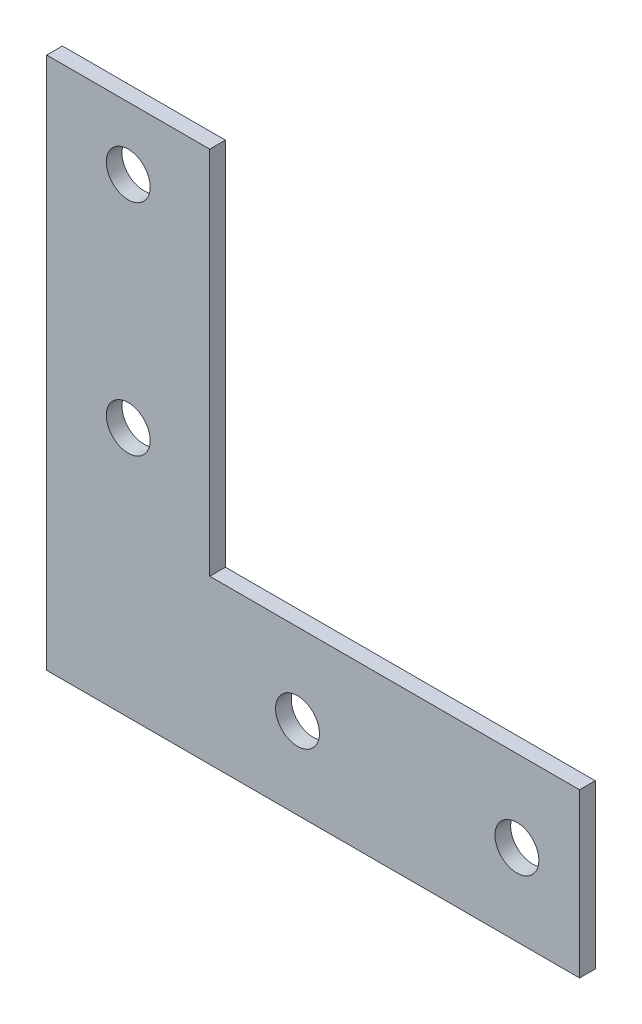
ISO-10303-21;
HEADER;
FILE_DESCRIPTION(('STEP AP214'),'2;1');
FILE_NAME('part.step','',(''),(''),'','','');
FILE_SCHEMA(('AUTOMOTIVE_DESIGN { 1 0 10303 214 1 1 1 1 }'));
ENDSEC;
DATA;
#1=APPLICATION_CONTEXT('core data for automotive mechanical design processes');
#2=APPLICATION_PROTOCOL_DEFINITION('international standard','automotive_design',2000,#1);
#3=PRODUCT_CONTEXT('',#1,'mechanical');
#4=PRODUCT('Part','Part','',(#3));
#5=PRODUCT_RELATED_PRODUCT_CATEGORY('part','',(#4));
#6=PRODUCT_DEFINITION_FORMATION('','',#4);
#7=PRODUCT_DEFINITION_CONTEXT('part definition',#1,'design');
#8=PRODUCT_DEFINITION('design','',#6,#7);
#9=PRODUCT_DEFINITION_SHAPE('','',#8);
#10=(LENGTH_UNIT() NAMED_UNIT(*) SI_UNIT(.MILLI.,.METRE.));
#11=(NAMED_UNIT(*) PLANE_ANGLE_UNIT() SI_UNIT($,.RADIAN.));
#12=(NAMED_UNIT(*) SI_UNIT($,.STERADIAN.) SOLID_ANGLE_UNIT());
#13=UNCERTAINTY_MEASURE_WITH_UNIT(LENGTH_MEASURE(1.E-05),#10,'distance_accuracy_value','');
#14=(GEOMETRIC_REPRESENTATION_CONTEXT(3) GLOBAL_UNCERTAINTY_ASSIGNED_CONTEXT((#13)) GLOBAL_UNIT_ASSIGNED_CONTEXT((#10,
#11,#12)) REPRESENTATION_CONTEXT('',''));
#15=CARTESIAN_POINT('',(0.,0.,0.));
#16=DIRECTION('',(0.,0.,1.));
#17=DIRECTION('',(1.,0.,0.));
#18=AXIS2_PLACEMENT_3D('',#15,#16,#17);
#19=CARTESIAN_POINT('',(0.,0.,2.5));
#20=DIRECTION('',(0.,0.,1.));
#21=DIRECTION('',(1.,0.,0.));
#22=AXIS2_PLACEMENT_3D('',#19,#20,#21);
#23=PLANE('',#22);
#24=CARTESIAN_POINT('',(40.,13.,2.5));
#25=DIRECTION('',(0.,0.,1.));
#26=DIRECTION('',(1.,0.,0.));
#27=AXIS2_PLACEMENT_3D('',#24,#25,#26);
#28=CIRCLE('',#27,3.5);
#29=CARTESIAN_POINT('',(43.5,13.,2.5));
#30=VERTEX_POINT('',#29);
#31=EDGE_CURVE('E190',#30,#30,#28,.T.);
#32=ORIENTED_EDGE('',*,*,#31,.F.);
#33=EDGE_LOOP('',(#32));
#34=FACE_BOUND('',#33,.T.);
#35=CARTESIAN_POINT('',(13.,75.,2.5));
#36=DIRECTION('',(0.,0.,1.));
#37=DIRECTION('',(1.,0.,0.));
#38=AXIS2_PLACEMENT_3D('',#35,#36,#37);
#39=CIRCLE('',#38,3.5);
#40=CARTESIAN_POINT('',(16.5,75.,2.5));
#41=VERTEX_POINT('',#40);
#42=EDGE_CURVE('E123',#41,#41,#39,.T.);
#43=ORIENTED_EDGE('',*,*,#42,.F.);
#44=EDGE_LOOP('',(#43));
#45=FACE_BOUND('',#44,.T.);
#46=DIRECTION('',(-1.,0.,0.));
#47=VECTOR('',#46,1.);
#48=CARTESIAN_POINT('',(26.,85.,2.5));
#49=LINE('',#48,#47);
#50=CARTESIAN_POINT('',(26.,85.,2.5));
#51=VERTEX_POINT('',#50);
#52=CARTESIAN_POINT('',(0.,85.,2.5));
#53=VERTEX_POINT('',#52);
#54=EDGE_CURVE('E130',#51,#53,#49,.T.);
#55=ORIENTED_EDGE('',*,*,#54,.T.);
#56=DIRECTION('',(0.,-1.,0.));
#57=VECTOR('',#56,1.);
#58=CARTESIAN_POINT('',(0.,85.,2.5));
#59=LINE('',#58,#57);
#60=CARTESIAN_POINT('',(0.,0.,2.5));
#61=VERTEX_POINT('',#60);
#62=EDGE_CURVE('E88',#53,#61,#59,.T.);
#63=ORIENTED_EDGE('',*,*,#62,.T.);
#64=DIRECTION('',(1.,0.,0.));
#65=VECTOR('',#64,1.);
#66=CARTESIAN_POINT('',(0.,0.,2.5));
#67=LINE('',#66,#65);
#68=CARTESIAN_POINT('',(85.,0.,2.5));
#69=VERTEX_POINT('',#68);
#70=EDGE_CURVE('E101',#61,#69,#67,.T.);
#71=ORIENTED_EDGE('',*,*,#70,.T.);
#72=DIRECTION('',(0.,1.,0.));
#73=VECTOR('',#72,1.);
#74=CARTESIAN_POINT('',(85.,0.,2.5));
#75=LINE('',#74,#73);
#76=CARTESIAN_POINT('',(85.,26.,2.5));
#77=VERTEX_POINT('',#76);
#78=EDGE_CURVE('E95',#69,#77,#75,.T.);
#79=ORIENTED_EDGE('',*,*,#78,.T.);
#80=DIRECTION('',(-1.,0.,0.));
#81=VECTOR('',#80,1.);
#82=CARTESIAN_POINT('',(85.,26.,2.5));
#83=LINE('',#82,#81);
#84=CARTESIAN_POINT('',(26.,26.,2.5));
#85=VERTEX_POINT('',#84);
#86=EDGE_CURVE('E99',#77,#85,#83,.T.);
#87=ORIENTED_EDGE('',*,*,#86,.T.);
#88=DIRECTION('',(0.,1.,0.));
#89=VECTOR('',#88,1.);
#90=CARTESIAN_POINT('',(26.,26.,2.5));
#91=LINE('',#90,#89);
#92=EDGE_CURVE('E51',#85,#51,#91,.T.);
#93=ORIENTED_EDGE('',*,*,#92,.T.);
#94=EDGE_LOOP('',(#55,#63,#71,#79,#87,#93));
#95=FACE_BOUND('',#94,.T.);
#96=CARTESIAN_POINT('',(13.,40.,2.5));
#97=DIRECTION('',(0.,0.,1.));
#98=DIRECTION('',(1.,0.,0.));
#99=AXIS2_PLACEMENT_3D('',#96,#97,#98);
#100=CIRCLE('',#99,3.5);
#101=CARTESIAN_POINT('',(16.5,40.,2.5));
#102=VERTEX_POINT('',#101);
#103=EDGE_CURVE('E196',#102,#102,#100,.T.);
#104=ORIENTED_EDGE('',*,*,#103,.F.);
#105=EDGE_LOOP('',(#104));
#106=FACE_BOUND('',#105,.T.);
#107=CARTESIAN_POINT('',(75.,13.,2.5));
#108=DIRECTION('',(0.,0.,1.));
#109=DIRECTION('',(1.,0.,0.));
#110=AXIS2_PLACEMENT_3D('',#107,#108,#109);
#111=CIRCLE('',#110,3.50000000000001);
#112=CARTESIAN_POINT('',(78.5,13.,2.5));
#113=VERTEX_POINT('',#112);
#114=EDGE_CURVE('E181',#113,#113,#111,.T.);
#115=ORIENTED_EDGE('',*,*,#114,.F.);
#116=EDGE_LOOP('',(#115));
#117=FACE_BOUND('',#116,.T.);
#118=ADVANCED_FACE('F34',(#34,#45,#95,#106,#117),#23,.T.);
#119=CARTESIAN_POINT('',(0.,0.,0.));
#120=DIRECTION('',(0.,0.,1.));
#121=DIRECTION('',(1.,0.,0.));
#122=AXIS2_PLACEMENT_3D('',#119,#120,#121);
#123=PLANE('',#122);
#124=DIRECTION('',(-1.,0.,0.));
#125=VECTOR('',#124,1.);
#126=CARTESIAN_POINT('',(26.,85.,0.));
#127=LINE('',#126,#125);
#128=CARTESIAN_POINT('',(26.,85.,0.));
#129=VERTEX_POINT('',#128);
#130=CARTESIAN_POINT('',(0.,85.,0.));
#131=VERTEX_POINT('',#130);
#132=EDGE_CURVE('E119',#129,#131,#127,.T.);
#133=ORIENTED_EDGE('',*,*,#132,.F.);
#134=DIRECTION('',(0.,1.,0.));
#135=VECTOR('',#134,1.);
#136=CARTESIAN_POINT('',(26.,26.,0.));
#137=LINE('',#136,#135);
#138=CARTESIAN_POINT('',(26.,26.,0.));
#139=VERTEX_POINT('',#138);
#140=EDGE_CURVE('E80',#139,#129,#137,.T.);
#141=ORIENTED_EDGE('',*,*,#140,.F.);
#142=DIRECTION('',(-1.,0.,0.));
#143=VECTOR('',#142,1.);
#144=CARTESIAN_POINT('',(85.,26.,0.));
#145=LINE('',#144,#143);
#146=CARTESIAN_POINT('',(85.,26.,0.));
#147=VERTEX_POINT('',#146);
#148=EDGE_CURVE('E74',#147,#139,#145,.T.);
#149=ORIENTED_EDGE('',*,*,#148,.F.);
#150=DIRECTION('',(0.,1.,0.));
#151=VECTOR('',#150,1.);
#152=CARTESIAN_POINT('',(85.,0.,0.));
#153=LINE('',#152,#151);
#154=CARTESIAN_POINT('',(85.,0.,0.));
#155=VERTEX_POINT('',#154);
#156=EDGE_CURVE('E109',#155,#147,#153,.T.);
#157=ORIENTED_EDGE('',*,*,#156,.F.);
#158=DIRECTION('',(1.,0.,0.));
#159=VECTOR('',#158,1.);
#160=CARTESIAN_POINT('',(0.,0.,0.));
#161=LINE('',#160,#159);
#162=CARTESIAN_POINT('',(0.,0.,0.));
#163=VERTEX_POINT('',#162);
#164=EDGE_CURVE('E125',#163,#155,#161,.T.);
#165=ORIENTED_EDGE('',*,*,#164,.F.);
#166=DIRECTION('',(0.,-1.,0.));
#167=VECTOR('',#166,1.);
#168=CARTESIAN_POINT('',(0.,85.,0.));
#169=LINE('',#168,#167);
#170=EDGE_CURVE('E122',#131,#163,#169,.T.);
#171=ORIENTED_EDGE('',*,*,#170,.F.);
#172=EDGE_LOOP('',(#133,#141,#149,#157,#165,#171));
#173=FACE_BOUND('',#172,.T.);
#174=CARTESIAN_POINT('',(13.,75.,0.));
#175=DIRECTION('',(0.,0.,1.));
#176=DIRECTION('',(1.,0.,0.));
#177=AXIS2_PLACEMENT_3D('',#174,#175,#176);
#178=CIRCLE('',#177,3.5);
#179=CARTESIAN_POINT('',(16.5,75.,0.));
#180=VERTEX_POINT('',#179);
#181=EDGE_CURVE('E199',#180,#180,#178,.T.);
#182=ORIENTED_EDGE('',*,*,#181,.T.);
#183=EDGE_LOOP('',(#182));
#184=FACE_BOUND('',#183,.T.);
#185=CARTESIAN_POINT('',(13.,40.,0.));
#186=DIRECTION('',(0.,0.,1.));
#187=DIRECTION('',(1.,0.,0.));
#188=AXIS2_PLACEMENT_3D('',#185,#186,#187);
#189=CIRCLE('',#188,3.5);
#190=CARTESIAN_POINT('',(16.5,40.,0.));
#191=VERTEX_POINT('',#190);
#192=EDGE_CURVE('E193',#191,#191,#189,.T.);
#193=ORIENTED_EDGE('',*,*,#192,.T.);
#194=EDGE_LOOP('',(#193));
#195=FACE_BOUND('',#194,.T.);
#196=CARTESIAN_POINT('',(40.,13.,0.));
#197=DIRECTION('',(0.,0.,1.));
#198=DIRECTION('',(1.,0.,0.));
#199=AXIS2_PLACEMENT_3D('',#196,#197,#198);
#200=CIRCLE('',#199,3.5);
#201=CARTESIAN_POINT('',(43.5,13.,0.));
#202=VERTEX_POINT('',#201);
#203=EDGE_CURVE('E187',#202,#202,#200,.T.);
#204=ORIENTED_EDGE('',*,*,#203,.T.);
#205=EDGE_LOOP('',(#204));
#206=FACE_BOUND('',#205,.T.);
#207=CARTESIAN_POINT('',(75.,13.,0.));
#208=DIRECTION('',(0.,0.,1.));
#209=DIRECTION('',(1.,0.,0.));
#210=AXIS2_PLACEMENT_3D('',#207,#208,#209);
#211=CIRCLE('',#210,3.50000000000001);
#212=CARTESIAN_POINT('',(78.5,13.,0.));
#213=VERTEX_POINT('',#212);
#214=EDGE_CURVE('E184',#213,#213,#211,.T.);
#215=ORIENTED_EDGE('',*,*,#214,.T.);
#216=EDGE_LOOP('',(#215));
#217=FACE_BOUND('',#216,.T.);
#218=ADVANCED_FACE('F139',(#173,#184,#195,#206,#217),#123,.F.);
#219=CARTESIAN_POINT('',(26.,85.,2.5));
#220=DIRECTION('',(0.,-1.,0.));
#221=DIRECTION('',(1.,0.,0.));
#222=AXIS2_PLACEMENT_3D('',#219,#220,#221);
#223=PLANE('',#222);
#224=ORIENTED_EDGE('',*,*,#132,.T.);
#225=DIRECTION('',(0.,0.,-1.));
#226=VECTOR('',#225,1.);
#227=CARTESIAN_POINT('',(0.,85.,2.5));
#228=LINE('',#227,#226);
#229=EDGE_CURVE('E11',#53,#131,#228,.T.);
#230=ORIENTED_EDGE('',*,*,#229,.F.);
#231=ORIENTED_EDGE('',*,*,#54,.F.);
#232=DIRECTION('',(0.,0.,-1.));
#233=VECTOR('',#232,1.);
#234=CARTESIAN_POINT('',(26.,85.,2.5));
#235=LINE('',#234,#233);
#236=EDGE_CURVE('E115',#51,#129,#235,.T.);
#237=ORIENTED_EDGE('',*,*,#236,.T.);
#238=EDGE_LOOP('',(#224,#230,#231,#237));
#239=FACE_BOUND('',#238,.T.);
#240=ADVANCED_FACE('F36',(#239),#223,.F.);
#241=CARTESIAN_POINT('',(0.,85.,2.5));
#242=DIRECTION('',(1.,0.,0.));
#243=DIRECTION('',(0.,1.,0.));
#244=AXIS2_PLACEMENT_3D('',#241,#242,#243);
#245=PLANE('',#244);
#246=ORIENTED_EDGE('',*,*,#170,.T.);
#247=DIRECTION('',(0.,0.,-1.));
#248=VECTOR('',#247,1.);
#249=CARTESIAN_POINT('',(0.,0.,2.5));
#250=LINE('',#249,#248);
#251=EDGE_CURVE('E43',#61,#163,#250,.T.);
#252=ORIENTED_EDGE('',*,*,#251,.F.);
#253=ORIENTED_EDGE('',*,*,#62,.F.);
#254=ORIENTED_EDGE('',*,*,#229,.T.);
#255=EDGE_LOOP('',(#246,#252,#253,#254));
#256=FACE_BOUND('',#255,.T.);
#257=ADVANCED_FACE('F257',(#256),#245,.F.);
#258=CARTESIAN_POINT('',(0.,0.,2.5));
#259=DIRECTION('',(0.,1.,0.));
#260=DIRECTION('',(0.,0.,1.));
#261=AXIS2_PLACEMENT_3D('',#258,#259,#260);
#262=PLANE('',#261);
#263=ORIENTED_EDGE('',*,*,#164,.T.);
#264=DIRECTION('',(0.,0.,-1.));
#265=VECTOR('',#264,1.);
#266=CARTESIAN_POINT('',(85.,0.,2.5));
#267=LINE('',#266,#265);
#268=EDGE_CURVE('E110',#69,#155,#267,.T.);
#269=ORIENTED_EDGE('',*,*,#268,.F.);
#270=ORIENTED_EDGE('',*,*,#70,.F.);
#271=ORIENTED_EDGE('',*,*,#251,.T.);
#272=EDGE_LOOP('',(#263,#269,#270,#271));
#273=FACE_BOUND('',#272,.T.);
#274=ADVANCED_FACE('F136',(#273),#262,.F.);
#275=CARTESIAN_POINT('',(85.,0.,2.5));
#276=DIRECTION('',(-1.,0.,0.));
#277=DIRECTION('',(0.,-1.,0.));
#278=AXIS2_PLACEMENT_3D('',#275,#276,#277);
#279=PLANE('',#278);
#280=ORIENTED_EDGE('',*,*,#156,.T.);
#281=DIRECTION('',(0.,0.,-1.));
#282=VECTOR('',#281,1.);
#283=CARTESIAN_POINT('',(85.,26.,2.5));
#284=LINE('',#283,#282);
#285=EDGE_CURVE('E106',#77,#147,#284,.T.);
#286=ORIENTED_EDGE('',*,*,#285,.F.);
#287=ORIENTED_EDGE('',*,*,#78,.F.);
#288=ORIENTED_EDGE('',*,*,#268,.T.);
#289=EDGE_LOOP('',(#280,#286,#287,#288));
#290=FACE_BOUND('',#289,.T.);
#291=ADVANCED_FACE('F107',(#290),#279,.F.);
#292=CARTESIAN_POINT('',(85.,26.,2.5));
#293=DIRECTION('',(0.,-1.,0.));
#294=DIRECTION('',(1.,0.,0.));
#295=AXIS2_PLACEMENT_3D('',#292,#293,#294);
#296=PLANE('',#295);
#297=ORIENTED_EDGE('',*,*,#148,.T.);
#298=DIRECTION('',(0.,0.,-1.));
#299=VECTOR('',#298,1.);
#300=CARTESIAN_POINT('',(26.,26.,2.5));
#301=LINE('',#300,#299);
#302=EDGE_CURVE('E111',#85,#139,#301,.T.);
#303=ORIENTED_EDGE('',*,*,#302,.F.);
#304=ORIENTED_EDGE('',*,*,#86,.F.);
#305=ORIENTED_EDGE('',*,*,#285,.T.);
#306=EDGE_LOOP('',(#297,#303,#304,#305));
#307=FACE_BOUND('',#306,.T.);
#308=ADVANCED_FACE('F113',(#307),#296,.F.);
#309=CARTESIAN_POINT('',(26.,26.,2.5));
#310=DIRECTION('',(-1.,0.,0.));
#311=DIRECTION('',(0.,-1.,0.));
#312=AXIS2_PLACEMENT_3D('',#309,#310,#311);
#313=PLANE('',#312);
#314=ORIENTED_EDGE('',*,*,#140,.T.);
#315=ORIENTED_EDGE('',*,*,#236,.F.);
#316=ORIENTED_EDGE('',*,*,#92,.F.);
#317=ORIENTED_EDGE('',*,*,#302,.T.);
#318=EDGE_LOOP('',(#314,#315,#316,#317));
#319=FACE_BOUND('',#318,.T.);
#320=ADVANCED_FACE('F144',(#319),#313,.F.);
#321=CARTESIAN_POINT('',(13.,75.,2.5));
#322=DIRECTION('',(0.,0.,-1.));
#323=DIRECTION('',(-1.,0.,0.));
#324=AXIS2_PLACEMENT_3D('',#321,#322,#323);
#325=CYLINDRICAL_SURFACE('',#324,3.5);
#326=ORIENTED_EDGE('',*,*,#42,.T.);
#327=EDGE_LOOP('',(#326));
#328=FACE_BOUND('',#327,.T.);
#329=ORIENTED_EDGE('',*,*,#181,.F.);
#330=EDGE_LOOP('',(#329));
#331=FACE_BOUND('',#330,.T.);
#332=ADVANCED_FACE('F146',(#328,#331),#325,.F.);
#333=CARTESIAN_POINT('',(13.,40.,2.5));
#334=DIRECTION('',(0.,0.,-1.));
#335=DIRECTION('',(-1.,0.,0.));
#336=AXIS2_PLACEMENT_3D('',#333,#334,#335);
#337=CYLINDRICAL_SURFACE('',#336,3.5);
#338=ORIENTED_EDGE('',*,*,#103,.T.);
#339=EDGE_LOOP('',(#338));
#340=FACE_BOUND('',#339,.T.);
#341=ORIENTED_EDGE('',*,*,#192,.F.);
#342=EDGE_LOOP('',(#341));
#343=FACE_BOUND('',#342,.T.);
#344=ADVANCED_FACE('F152',(#340,#343),#337,.F.);
#345=CARTESIAN_POINT('',(40.,13.,2.5));
#346=DIRECTION('',(0.,0.,-1.));
#347=DIRECTION('',(-1.,0.,0.));
#348=AXIS2_PLACEMENT_3D('',#345,#346,#347);
#349=CYLINDRICAL_SURFACE('',#348,3.5);
#350=ORIENTED_EDGE('',*,*,#31,.T.);
#351=EDGE_LOOP('',(#350));
#352=FACE_BOUND('',#351,.T.);
#353=ORIENTED_EDGE('',*,*,#203,.F.);
#354=EDGE_LOOP('',(#353));
#355=FACE_BOUND('',#354,.T.);
#356=ADVANCED_FACE('F168',(#352,#355),#349,.F.);
#357=CARTESIAN_POINT('',(75.,13.,2.5));
#358=DIRECTION('',(0.,0.,-1.));
#359=DIRECTION('',(-1.,0.,0.));
#360=AXIS2_PLACEMENT_3D('',#357,#358,#359);
#361=CYLINDRICAL_SURFACE('',#360,3.50000000000001);
#362=ORIENTED_EDGE('',*,*,#114,.T.);
#363=EDGE_LOOP('',(#362));
#364=FACE_BOUND('',#363,.T.);
#365=ORIENTED_EDGE('',*,*,#214,.F.);
#366=EDGE_LOOP('',(#365));
#367=FACE_BOUND('',#366,.T.);
#368=ADVANCED_FACE('F172',(#364,#367),#361,.F.);
#369=CLOSED_SHELL('',(#118,#218,#240,#257,#274,#291,#308,#320,#332,#344,#356,#368));
#370=MANIFOLD_SOLID_BREP('B2',#369);
#371=ADVANCED_BREP_SHAPE_REPRESENTATION('',(#18,#370),#14);
#372=SHAPE_DEFINITION_REPRESENTATION(#9,#371);
ENDSEC;
END-ISO-10303-21;
